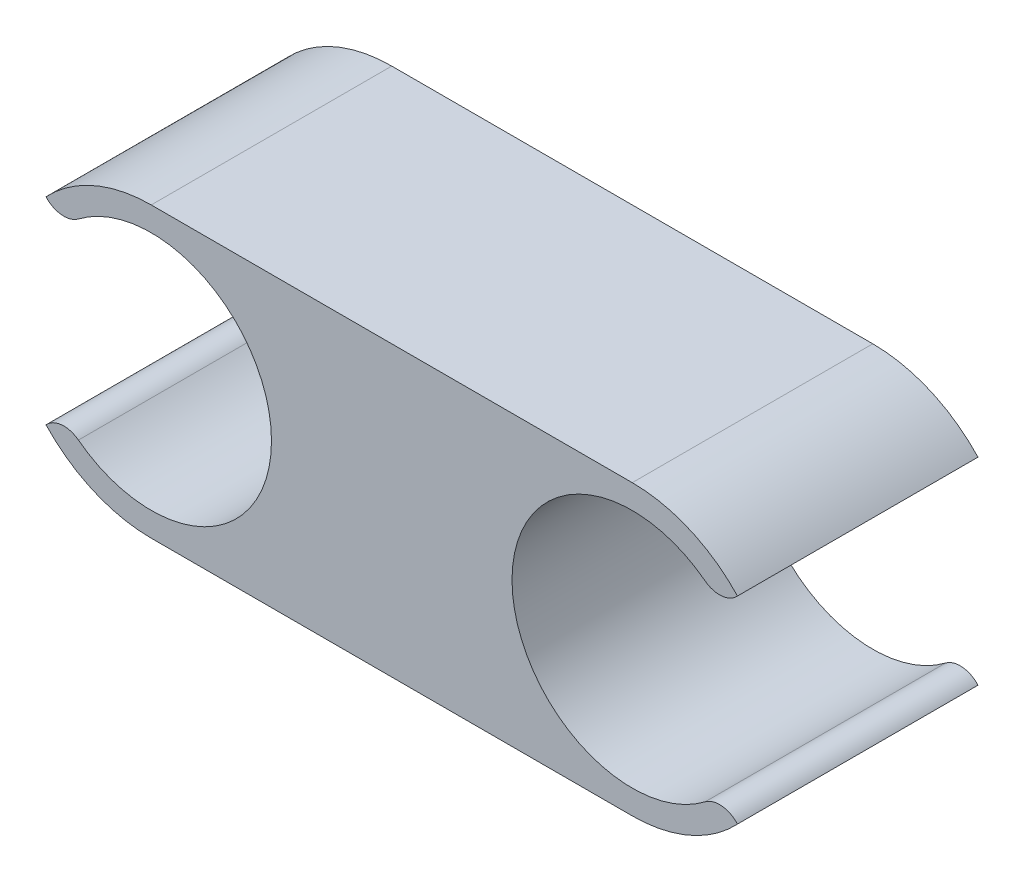
ISO-10303-21;
HEADER;
FILE_DESCRIPTION(('STEP AP214'),'2;1');
FILE_NAME('part.step','',(''),(''),'','','');
FILE_SCHEMA(('AUTOMOTIVE_DESIGN { 1 0 10303 214 1 1 1 1 }'));
ENDSEC;
DATA;
#1=APPLICATION_CONTEXT('core data for automotive mechanical design processes');
#2=APPLICATION_PROTOCOL_DEFINITION('international standard','automotive_design',2000,#1);
#3=PRODUCT_CONTEXT('',#1,'mechanical');
#4=PRODUCT('Part','Part','',(#3));
#5=PRODUCT_RELATED_PRODUCT_CATEGORY('part','',(#4));
#6=PRODUCT_DEFINITION_FORMATION('','',#4);
#7=PRODUCT_DEFINITION_CONTEXT('part definition',#1,'design');
#8=PRODUCT_DEFINITION('design','',#6,#7);
#9=PRODUCT_DEFINITION_SHAPE('','',#8);
#10=(LENGTH_UNIT() NAMED_UNIT(*) SI_UNIT(.MILLI.,.METRE.));
#11=(NAMED_UNIT(*) PLANE_ANGLE_UNIT() SI_UNIT($,.RADIAN.));
#12=(NAMED_UNIT(*) SI_UNIT($,.STERADIAN.) SOLID_ANGLE_UNIT());
#13=UNCERTAINTY_MEASURE_WITH_UNIT(LENGTH_MEASURE(1.E-05),#10,'distance_accuracy_value','');
#14=(GEOMETRIC_REPRESENTATION_CONTEXT(3) GLOBAL_UNCERTAINTY_ASSIGNED_CONTEXT((#13)) GLOBAL_UNIT_ASSIGNED_CONTEXT((#10,
#11,#12)) REPRESENTATION_CONTEXT('',''));
#15=CARTESIAN_POINT('',(0.,0.,0.));
#16=DIRECTION('',(0.,0.,1.));
#17=DIRECTION('',(1.,0.,0.));
#18=AXIS2_PLACEMENT_3D('',#15,#16,#17);
#19=CARTESIAN_POINT('',(0.,-22.1893101255762,8.));
#20=DIRECTION('',(0.,1.,0.));
#21=DIRECTION('',(0.,0.,1.));
#22=AXIS2_PLACEMENT_3D('',#19,#20,#21);
#23=PLANE('',#22);
#24=DIRECTION('',(1.,0.,0.));
#25=VECTOR('',#24,1.);
#26=CARTESIAN_POINT('',(0.,-22.1893101255762,0.));
#27=LINE('',#26,#25);
#28=CARTESIAN_POINT('',(-41.4710554760769,-22.1893101255762,0.));
#29=VERTEX_POINT('',#28);
#30=CARTESIAN_POINT('',(-25.4710554760769,-22.1893101255762,0.));
#31=VERTEX_POINT('',#30);
#32=EDGE_CURVE('E155',#29,#31,#27,.T.);
#33=ORIENTED_EDGE('',*,*,#32,.T.);
#34=DIRECTION('',(0.,0.,-1.));
#35=VECTOR('',#34,1.);
#36=CARTESIAN_POINT('',(-25.4710554760769,-22.1893101255762,8.));
#37=LINE('',#36,#35);
#38=CARTESIAN_POINT('',(-25.4710554760769,-22.1893101255762,8.));
#39=VERTEX_POINT('',#38);
#40=EDGE_CURVE('E135',#39,#31,#37,.T.);
#41=ORIENTED_EDGE('',*,*,#40,.F.);
#42=DIRECTION('',(1.,0.,0.));
#43=VECTOR('',#42,1.);
#44=CARTESIAN_POINT('',(0.,-22.1893101255762,8.));
#45=LINE('',#44,#43);
#46=CARTESIAN_POINT('',(-41.4710554760769,-22.1893101255762,8.));
#47=VERTEX_POINT('',#46);
#48=EDGE_CURVE('E142',#47,#39,#45,.T.);
#49=ORIENTED_EDGE('',*,*,#48,.F.);
#50=DIRECTION('',(0.,0.,-1.));
#51=VECTOR('',#50,1.);
#52=CARTESIAN_POINT('',(-41.4710554760769,-22.1893101255762,8.));
#53=LINE('',#52,#51);
#54=EDGE_CURVE('E216',#47,#29,#53,.T.);
#55=ORIENTED_EDGE('',*,*,#54,.T.);
#56=EDGE_LOOP('',(#33,#41,#49,#55));
#57=FACE_BOUND('',#56,.T.);
#58=ADVANCED_FACE('F41',(#57),#23,.F.);
#59=CARTESIAN_POINT('',(-25.4710554760769,-17.3893101255762,8.));
#60=DIRECTION('',(0.,0.,-1.));
#61=DIRECTION('',(-1.,0.,0.));
#62=AXIS2_PLACEMENT_3D('',#59,#60,#61);
#63=CYLINDRICAL_SURFACE('',#62,4.8);
#64=CARTESIAN_POINT('',(-25.4710554760769,-17.3893101255762,0.));
#65=DIRECTION('',(0.,0.,1.));
#66=DIRECTION('',(1.,0.,0.));
#67=AXIS2_PLACEMENT_3D('',#64,#65,#66);
#68=CIRCLE('',#67,4.8);
#69=CARTESIAN_POINT('',(-21.9710554760769,-20.6741236667076,0.));
#70=VERTEX_POINT('',#69);
#71=EDGE_CURVE('E253',#31,#70,#68,.T.);
#72=ORIENTED_EDGE('',*,*,#71,.T.);
#73=DIRECTION('',(0.,0.,-1.));
#74=VECTOR('',#73,1.);
#75=CARTESIAN_POINT('',(-21.9710554760769,-20.6741236667076,8.));
#76=LINE('',#75,#74);
#77=CARTESIAN_POINT('',(-21.9710554760769,-20.6741236667076,8.));
#78=VERTEX_POINT('',#77);
#79=EDGE_CURVE('E138',#78,#70,#76,.T.);
#80=ORIENTED_EDGE('',*,*,#79,.F.);
#81=CARTESIAN_POINT('',(-25.4710554760769,-17.3893101255762,8.));
#82=DIRECTION('',(0.,0.,1.));
#83=DIRECTION('',(1.,0.,0.));
#84=AXIS2_PLACEMENT_3D('',#81,#82,#83);
#85=CIRCLE('',#84,4.8);
#86=EDGE_CURVE('E130',#39,#78,#85,.T.);
#87=ORIENTED_EDGE('',*,*,#86,.F.);
#88=ORIENTED_EDGE('',*,*,#40,.T.);
#89=EDGE_LOOP('',(#72,#80,#87,#88));
#90=FACE_BOUND('',#89,.T.);
#91=ADVANCED_FACE('F133',(#90),#63,.T.);
#92=CARTESIAN_POINT('',(-25.4710554760769,-17.3893101255762,8.));
#93=DIRECTION('',(0.,0.,-1.));
#94=DIRECTION('',(-1.,0.,0.));
#95=AXIS2_PLACEMENT_3D('',#92,#93,#94);
#96=CYLINDRICAL_SURFACE('',#95,4.);
#97=CARTESIAN_POINT('',(-25.4710554760769,-17.3893101255762,8.));
#98=DIRECTION('',(0.,0.,1.));
#99=DIRECTION('',(1.,0.,0.));
#100=AXIS2_PLACEMENT_3D('',#97,#98,#99);
#101=CIRCLE('',#100,4.);
#102=CARTESIAN_POINT('',(-23.0495353003515,-14.2055638984792,8.));
#103=VERTEX_POINT('',#102);
#104=CARTESIAN_POINT('',(-23.0495353003515,-20.5730563526732,8.));
#105=VERTEX_POINT('',#104);
#106=EDGE_CURVE('E141',#103,#105,#101,.T.);
#107=ORIENTED_EDGE('',*,*,#106,.T.);
#108=DIRECTION('',(0.,0.,-1.));
#109=VECTOR('',#108,1.);
#110=CARTESIAN_POINT('',(-23.0495353003515,-20.5730563526732,8.));
#111=LINE('',#110,#109);
#112=CARTESIAN_POINT('',(-23.0495353003515,-20.5730563526732,0.));
#113=VERTEX_POINT('',#112);
#114=EDGE_CURVE('E161',#105,#113,#111,.T.);
#115=ORIENTED_EDGE('',*,*,#114,.T.);
#116=CARTESIAN_POINT('',(-25.4710554760769,-17.3893101255762,0.));
#117=DIRECTION('',(0.,0.,1.));
#118=DIRECTION('',(1.,0.,0.));
#119=AXIS2_PLACEMENT_3D('',#116,#117,#118);
#120=CIRCLE('',#119,4.);
#121=CARTESIAN_POINT('',(-23.0495353003515,-14.2055638984792,0.));
#122=VERTEX_POINT('',#121);
#123=EDGE_CURVE('E249',#122,#113,#120,.T.);
#124=ORIENTED_EDGE('',*,*,#123,.F.);
#125=DIRECTION('',(0.,0.,-1.));
#126=VECTOR('',#125,1.);
#127=CARTESIAN_POINT('',(-23.0495353003515,-14.2055638984792,8.));
#128=LINE('',#127,#126);
#129=EDGE_CURVE('E157',#122,#103,#128,.F.);
#130=ORIENTED_EDGE('',*,*,#129,.T.);
#131=EDGE_LOOP('',(#107,#115,#124,#130));
#132=FACE_BOUND('',#131,.T.);
#133=ADVANCED_FACE('F278',(#132),#96,.F.);
#134=CARTESIAN_POINT('',(-25.4710554760769,-17.3893101255762,8.));
#135=DIRECTION('',(0.,0.,-1.));
#136=DIRECTION('',(-1.,0.,0.));
#137=AXIS2_PLACEMENT_3D('',#134,#135,#136);
#138=CYLINDRICAL_SURFACE('',#137,4.8);
#139=CARTESIAN_POINT('',(-25.4710554760769,-17.3893101255762,0.));
#140=DIRECTION('',(0.,0.,1.));
#141=DIRECTION('',(1.,0.,0.));
#142=AXIS2_PLACEMENT_3D('',#139,#140,#141);
#143=CIRCLE('',#142,4.8);
#144=CARTESIAN_POINT('',(-21.9710554760769,-14.1044965844448,0.));
#145=VERTEX_POINT('',#144);
#146=CARTESIAN_POINT('',(-25.4710554760769,-12.5893101255762,0.));
#147=VERTEX_POINT('',#146);
#148=EDGE_CURVE('E241',#145,#147,#143,.T.);
#149=ORIENTED_EDGE('',*,*,#148,.T.);
#150=DIRECTION('',(0.,0.,-1.));
#151=VECTOR('',#150,1.);
#152=CARTESIAN_POINT('',(-25.4710554760769,-12.5893101255762,8.));
#153=LINE('',#152,#151);
#154=CARTESIAN_POINT('',(-25.4710554760769,-12.5893101255762,8.));
#155=VERTEX_POINT('',#154);
#156=EDGE_CURVE('E230',#155,#147,#153,.T.);
#157=ORIENTED_EDGE('',*,*,#156,.F.);
#158=CARTESIAN_POINT('',(-25.4710554760769,-17.3893101255762,8.));
#159=DIRECTION('',(0.,0.,1.));
#160=DIRECTION('',(1.,0.,0.));
#161=AXIS2_PLACEMENT_3D('',#158,#159,#160);
#162=CIRCLE('',#161,4.8);
#163=CARTESIAN_POINT('',(-21.9710554760769,-14.1044965844448,8.));
#164=VERTEX_POINT('',#163);
#165=EDGE_CURVE('E243',#164,#155,#162,.T.);
#166=ORIENTED_EDGE('',*,*,#165,.F.);
#167=DIRECTION('',(0.,0.,-1.));
#168=VECTOR('',#167,1.);
#169=CARTESIAN_POINT('',(-21.9710554760769,-14.1044965844448,8.));
#170=LINE('',#169,#168);
#171=EDGE_CURVE('E163',#164,#145,#170,.T.);
#172=ORIENTED_EDGE('',*,*,#171,.T.);
#173=EDGE_LOOP('',(#149,#157,#166,#172));
#174=FACE_BOUND('',#173,.T.);
#175=ADVANCED_FACE('F239',(#174),#138,.T.);
#176=CARTESIAN_POINT('',(0.,-12.5893101255762,8.));
#177=DIRECTION('',(0.,1.,0.));
#178=DIRECTION('',(-1.,0.,0.));
#179=AXIS2_PLACEMENT_3D('',#176,#177,#178);
#180=PLANE('',#179);
#181=DIRECTION('',(1.,0.,0.));
#182=VECTOR('',#181,1.);
#183=CARTESIAN_POINT('',(0.,-12.5893101255762,0.));
#184=LINE('',#183,#182);
#185=CARTESIAN_POINT('',(-41.4710554760769,-12.5893101255762,0.));
#186=VERTEX_POINT('',#185);
#187=EDGE_CURVE('E212',#186,#147,#184,.T.);
#188=ORIENTED_EDGE('',*,*,#187,.F.);
#189=DIRECTION('',(0.,0.,-1.));
#190=VECTOR('',#189,1.);
#191=CARTESIAN_POINT('',(-41.4710554760769,-12.5893101255762,8.));
#192=LINE('',#191,#190);
#193=CARTESIAN_POINT('',(-41.4710554760769,-12.5893101255762,8.));
#194=VERTEX_POINT('',#193);
#195=EDGE_CURVE('E227',#194,#186,#192,.T.);
#196=ORIENTED_EDGE('',*,*,#195,.F.);
#197=DIRECTION('',(1.,0.,0.));
#198=VECTOR('',#197,1.);
#199=CARTESIAN_POINT('',(0.,-12.5893101255762,8.));
#200=LINE('',#199,#198);
#201=EDGE_CURVE('E267',#194,#155,#200,.T.);
#202=ORIENTED_EDGE('',*,*,#201,.T.);
#203=ORIENTED_EDGE('',*,*,#156,.T.);
#204=EDGE_LOOP('',(#188,#196,#202,#203));
#205=FACE_BOUND('',#204,.T.);
#206=ADVANCED_FACE('F285',(#205),#180,.T.);
#207=CARTESIAN_POINT('',(-41.4710554760769,-17.3893101255762,8.));
#208=DIRECTION('',(0.,0.,-1.));
#209=DIRECTION('',(-1.,0.,0.));
#210=AXIS2_PLACEMENT_3D('',#207,#208,#209);
#211=CYLINDRICAL_SURFACE('',#210,4.8);
#212=CARTESIAN_POINT('',(-41.4710554760769,-17.3893101255762,0.));
#213=DIRECTION('',(0.,0.,1.));
#214=DIRECTION('',(1.,0.,0.));
#215=AXIS2_PLACEMENT_3D('',#212,#213,#214);
#216=CIRCLE('',#215,4.8);
#217=CARTESIAN_POINT('',(-44.9710554760769,-14.1044965844449,0.));
#218=VERTEX_POINT('',#217);
#219=EDGE_CURVE('E207',#186,#218,#216,.T.);
#220=ORIENTED_EDGE('',*,*,#219,.T.);
#221=DIRECTION('',(0.,0.,-1.));
#222=VECTOR('',#221,1.);
#223=CARTESIAN_POINT('',(-44.9710554760769,-14.1044965844449,8.));
#224=LINE('',#223,#222);
#225=CARTESIAN_POINT('',(-44.9710554760769,-14.1044965844449,8.));
#226=VERTEX_POINT('',#225);
#227=EDGE_CURVE('E223',#226,#218,#224,.T.);
#228=ORIENTED_EDGE('',*,*,#227,.F.);
#229=CARTESIAN_POINT('',(-41.4710554760769,-17.3893101255762,8.));
#230=DIRECTION('',(0.,0.,1.));
#231=DIRECTION('',(1.,0.,0.));
#232=AXIS2_PLACEMENT_3D('',#229,#230,#231);
#233=CIRCLE('',#232,4.8);
#234=EDGE_CURVE('E264',#194,#226,#233,.T.);
#235=ORIENTED_EDGE('',*,*,#234,.F.);
#236=ORIENTED_EDGE('',*,*,#195,.T.);
#237=EDGE_LOOP('',(#220,#228,#235,#236));
#238=FACE_BOUND('',#237,.T.);
#239=ADVANCED_FACE('F289',(#238),#211,.T.);
#240=CARTESIAN_POINT('',(-41.4710554760769,-17.3893101255762,8.));
#241=DIRECTION('',(0.,0.,-1.));
#242=DIRECTION('',(-1.,0.,0.));
#243=AXIS2_PLACEMENT_3D('',#240,#241,#242);
#244=CYLINDRICAL_SURFACE('',#243,4.00000000000001);
#245=CARTESIAN_POINT('',(-41.4710554760769,-17.3893101255762,0.));
#246=DIRECTION('',(0.,0.,1.));
#247=DIRECTION('',(1.,0.,0.));
#248=AXIS2_PLACEMENT_3D('',#245,#246,#247);
#249=CIRCLE('',#248,4.00000000000001);
#250=CARTESIAN_POINT('',(-43.8925756518024,-20.5730563526732,0.));
#251=VERTEX_POINT('',#250);
#252=CARTESIAN_POINT('',(-43.8925756518024,-14.2055638984792,0.));
#253=VERTEX_POINT('',#252);
#254=EDGE_CURVE('E197',#251,#253,#249,.T.);
#255=ORIENTED_EDGE('',*,*,#254,.F.);
#256=DIRECTION('',(0.,0.,-1.));
#257=VECTOR('',#256,1.);
#258=CARTESIAN_POINT('',(-43.8925756518024,-20.5730563526732,8.));
#259=LINE('',#258,#257);
#260=CARTESIAN_POINT('',(-43.8925756518024,-20.5730563526732,8.));
#261=VERTEX_POINT('',#260);
#262=EDGE_CURVE('E11',#251,#261,#259,.F.);
#263=ORIENTED_EDGE('',*,*,#262,.T.);
#264=CARTESIAN_POINT('',(-41.4710554760769,-17.3893101255762,8.));
#265=DIRECTION('',(0.,0.,1.));
#266=DIRECTION('',(1.,0.,0.));
#267=AXIS2_PLACEMENT_3D('',#264,#265,#266);
#268=CIRCLE('',#267,4.00000000000001);
#269=CARTESIAN_POINT('',(-43.8925756518024,-14.2055638984792,8.));
#270=VERTEX_POINT('',#269);
#271=EDGE_CURVE('E198',#261,#270,#268,.T.);
#272=ORIENTED_EDGE('',*,*,#271,.T.);
#273=DIRECTION('',(0.,0.,-1.));
#274=VECTOR('',#273,1.);
#275=CARTESIAN_POINT('',(-43.8925756518024,-14.2055638984792,8.));
#276=LINE('',#275,#274);
#277=EDGE_CURVE('E50',#270,#253,#276,.T.);
#278=ORIENTED_EDGE('',*,*,#277,.T.);
#279=EDGE_LOOP('',(#255,#263,#272,#278));
#280=FACE_BOUND('',#279,.T.);
#281=ADVANCED_FACE('F196',(#280),#244,.F.);
#282=CARTESIAN_POINT('',(-41.4710554760769,-17.3893101255762,8.));
#283=DIRECTION('',(0.,0.,-1.));
#284=DIRECTION('',(-1.,0.,0.));
#285=AXIS2_PLACEMENT_3D('',#282,#283,#284);
#286=CYLINDRICAL_SURFACE('',#285,4.8);
#287=CARTESIAN_POINT('',(-41.4710554760769,-17.3893101255762,0.));
#288=DIRECTION('',(0.,0.,1.));
#289=DIRECTION('',(1.,0.,0.));
#290=AXIS2_PLACEMENT_3D('',#287,#288,#289);
#291=CIRCLE('',#290,4.8);
#292=CARTESIAN_POINT('',(-44.9710554760769,-20.6741236667076,0.));
#293=VERTEX_POINT('',#292);
#294=EDGE_CURVE('E152',#293,#29,#291,.T.);
#295=ORIENTED_EDGE('',*,*,#294,.T.);
#296=ORIENTED_EDGE('',*,*,#54,.F.);
#297=CARTESIAN_POINT('',(-41.4710554760769,-17.3893101255762,8.));
#298=DIRECTION('',(0.,0.,1.));
#299=DIRECTION('',(1.,0.,0.));
#300=AXIS2_PLACEMENT_3D('',#297,#298,#299);
#301=CIRCLE('',#300,4.8);
#302=CARTESIAN_POINT('',(-44.9710554760769,-20.6741236667076,8.));
#303=VERTEX_POINT('',#302);
#304=EDGE_CURVE('E147',#303,#47,#301,.T.);
#305=ORIENTED_EDGE('',*,*,#304,.F.);
#306=DIRECTION('',(0.,0.,-1.));
#307=VECTOR('',#306,1.);
#308=CARTESIAN_POINT('',(-44.9710554760769,-20.6741236667076,8.));
#309=LINE('',#308,#307);
#310=EDGE_CURVE('E219',#303,#293,#309,.T.);
#311=ORIENTED_EDGE('',*,*,#310,.T.);
#312=EDGE_LOOP('',(#295,#296,#305,#311));
#313=FACE_BOUND('',#312,.T.);
#314=ADVANCED_FACE('F346',(#313),#286,.T.);
#315=CARTESIAN_POINT('',(0.,0.,8.));
#316=DIRECTION('',(0.,0.,1.));
#317=DIRECTION('',(1.,0.,0.));
#318=AXIS2_PLACEMENT_3D('',#315,#316,#317);
#319=PLANE('',#318);
#320=ORIENTED_EDGE('',*,*,#86,.T.);
#321=CARTESIAN_POINT('',(-22.5652312652064,-21.2098055980926,8.));
#322=DIRECTION('',(0.,0.,1.));
#323=DIRECTION('',(1.,0.,0.));
#324=AXIS2_PLACEMENT_3D('',#321,#322,#323);
#325=CIRCLE('',#324,0.8);
#326=EDGE_CURVE('E190',#78,#105,#325,.T.);
#327=ORIENTED_EDGE('',*,*,#326,.T.);
#328=ORIENTED_EDGE('',*,*,#106,.F.);
#329=CARTESIAN_POINT('',(-22.5652312652064,-13.5688146530598,8.));
#330=DIRECTION('',(0.,0.,1.));
#331=DIRECTION('',(1.,0.,0.));
#332=AXIS2_PLACEMENT_3D('',#329,#330,#331);
#333=CIRCLE('',#332,0.8);
#334=EDGE_CURVE('E187',#103,#164,#333,.T.);
#335=ORIENTED_EDGE('',*,*,#334,.T.);
#336=ORIENTED_EDGE('',*,*,#165,.T.);
#337=ORIENTED_EDGE('',*,*,#201,.F.);
#338=ORIENTED_EDGE('',*,*,#234,.T.);
#339=CARTESIAN_POINT('',(-44.3768796869475,-13.5688146530598,8.));
#340=DIRECTION('',(0.,0.,1.));
#341=DIRECTION('',(1.,0.,0.));
#342=AXIS2_PLACEMENT_3D('',#339,#340,#341);
#343=CIRCLE('',#342,0.8);
#344=EDGE_CURVE('E57',#226,#270,#343,.T.);
#345=ORIENTED_EDGE('',*,*,#344,.T.);
#346=ORIENTED_EDGE('',*,*,#271,.F.);
#347=CARTESIAN_POINT('',(-44.3768796869475,-21.2098055980926,8.));
#348=DIRECTION('',(0.,0.,1.));
#349=DIRECTION('',(1.,0.,0.));
#350=AXIS2_PLACEMENT_3D('',#347,#348,#349);
#351=CIRCLE('',#350,0.8);
#352=EDGE_CURVE('E184',#261,#303,#351,.T.);
#353=ORIENTED_EDGE('',*,*,#352,.T.);
#354=ORIENTED_EDGE('',*,*,#304,.T.);
#355=ORIENTED_EDGE('',*,*,#48,.T.);
#356=EDGE_LOOP('',(#320,#327,#328,#335,#336,#337,#338,#345,#346,#353,#354,#355));
#357=FACE_BOUND('',#356,.T.);
#358=ADVANCED_FACE('F145',(#357),#319,.T.);
#359=CARTESIAN_POINT('',(0.,0.,0.));
#360=DIRECTION('',(0.,0.,1.));
#361=DIRECTION('',(1.,0.,0.));
#362=AXIS2_PLACEMENT_3D('',#359,#360,#361);
#363=PLANE('',#362);
#364=ORIENTED_EDGE('',*,*,#123,.T.);
#365=CARTESIAN_POINT('',(-22.5652312652064,-21.2098055980926,0.));
#366=DIRECTION('',(0.,0.,1.));
#367=DIRECTION('',(1.,0.,0.));
#368=AXIS2_PLACEMENT_3D('',#365,#366,#367);
#369=CIRCLE('',#368,0.8);
#370=EDGE_CURVE('E179',#113,#70,#369,.F.);
#371=ORIENTED_EDGE('',*,*,#370,.T.);
#372=ORIENTED_EDGE('',*,*,#71,.F.);
#373=ORIENTED_EDGE('',*,*,#32,.F.);
#374=ORIENTED_EDGE('',*,*,#294,.F.);
#375=CARTESIAN_POINT('',(-44.3768796869475,-21.2098055980926,0.));
#376=DIRECTION('',(0.,0.,1.));
#377=DIRECTION('',(1.,0.,0.));
#378=AXIS2_PLACEMENT_3D('',#375,#376,#377);
#379=CIRCLE('',#378,0.8);
#380=EDGE_CURVE('E173',#293,#251,#379,.F.);
#381=ORIENTED_EDGE('',*,*,#380,.T.);
#382=ORIENTED_EDGE('',*,*,#254,.T.);
#383=CARTESIAN_POINT('',(-44.3768796869475,-13.5688146530598,0.));
#384=DIRECTION('',(0.,0.,1.));
#385=DIRECTION('',(1.,0.,0.));
#386=AXIS2_PLACEMENT_3D('',#383,#384,#385);
#387=CIRCLE('',#386,0.8);
#388=EDGE_CURVE('E170',#253,#218,#387,.F.);
#389=ORIENTED_EDGE('',*,*,#388,.T.);
#390=ORIENTED_EDGE('',*,*,#219,.F.);
#391=ORIENTED_EDGE('',*,*,#187,.T.);
#392=ORIENTED_EDGE('',*,*,#148,.F.);
#393=CARTESIAN_POINT('',(-22.5652312652064,-13.5688146530598,0.));
#394=DIRECTION('',(0.,0.,1.));
#395=DIRECTION('',(1.,0.,0.));
#396=AXIS2_PLACEMENT_3D('',#393,#394,#395);
#397=CIRCLE('',#396,0.8);
#398=EDGE_CURVE('E176',#145,#122,#397,.F.);
#399=ORIENTED_EDGE('',*,*,#398,.T.);
#400=EDGE_LOOP('',(#364,#371,#372,#373,#374,#381,#382,#389,#390,#391,#392,#399));
#401=FACE_BOUND('',#400,.T.);
#402=ADVANCED_FACE('F202',(#401),#363,.F.);
#403=CARTESIAN_POINT('',(-22.5652312652064,-21.2098055980926,8.));
#404=DIRECTION('',(0.,0.,-1.));
#405=DIRECTION('',(-1.,0.,0.));
#406=AXIS2_PLACEMENT_3D('',#403,#404,#405);
#407=CYLINDRICAL_SURFACE('',#406,0.8);
#408=ORIENTED_EDGE('',*,*,#326,.F.);
#409=ORIENTED_EDGE('',*,*,#79,.T.);
#410=ORIENTED_EDGE('',*,*,#370,.F.);
#411=ORIENTED_EDGE('',*,*,#114,.F.);
#412=EDGE_LOOP('',(#408,#409,#410,#411));
#413=FACE_BOUND('',#412,.T.);
#414=ADVANCED_FACE('F281',(#413),#407,.T.);
#415=CARTESIAN_POINT('',(-22.5652312652064,-13.5688146530598,8.));
#416=DIRECTION('',(0.,0.,-1.));
#417=DIRECTION('',(-1.,0.,0.));
#418=AXIS2_PLACEMENT_3D('',#415,#416,#417);
#419=CYLINDRICAL_SURFACE('',#418,0.8);
#420=ORIENTED_EDGE('',*,*,#334,.F.);
#421=ORIENTED_EDGE('',*,*,#129,.F.);
#422=ORIENTED_EDGE('',*,*,#398,.F.);
#423=ORIENTED_EDGE('',*,*,#171,.F.);
#424=EDGE_LOOP('',(#420,#421,#422,#423));
#425=FACE_BOUND('',#424,.T.);
#426=ADVANCED_FACE('F282',(#425),#419,.T.);
#427=CARTESIAN_POINT('',(-44.3768796869475,-21.2098055980926,8.));
#428=DIRECTION('',(0.,0.,-1.));
#429=DIRECTION('',(-1.,0.,0.));
#430=AXIS2_PLACEMENT_3D('',#427,#428,#429);
#431=CYLINDRICAL_SURFACE('',#430,0.8);
#432=ORIENTED_EDGE('',*,*,#352,.F.);
#433=ORIENTED_EDGE('',*,*,#262,.F.);
#434=ORIENTED_EDGE('',*,*,#380,.F.);
#435=ORIENTED_EDGE('',*,*,#310,.F.);
#436=EDGE_LOOP('',(#432,#433,#434,#435));
#437=FACE_BOUND('',#436,.T.);
#438=ADVANCED_FACE('F291',(#437),#431,.T.);
#439=CARTESIAN_POINT('',(-44.3768796869475,-13.5688146530598,8.));
#440=DIRECTION('',(0.,0.,-1.));
#441=DIRECTION('',(-1.,0.,0.));
#442=AXIS2_PLACEMENT_3D('',#439,#440,#441);
#443=CYLINDRICAL_SURFACE('',#442,0.8);
#444=ORIENTED_EDGE('',*,*,#344,.F.);
#445=ORIENTED_EDGE('',*,*,#227,.T.);
#446=ORIENTED_EDGE('',*,*,#388,.F.);
#447=ORIENTED_EDGE('',*,*,#277,.F.);
#448=EDGE_LOOP('',(#444,#445,#446,#447));
#449=FACE_BOUND('',#448,.T.);
#450=ADVANCED_FACE('F43',(#449),#443,.T.);
#451=CLOSED_SHELL('',(#58,#91,#133,#175,#206,#239,#281,#314,#358,#402,#414,#426,#438,#450));
#452=MANIFOLD_SOLID_BREP('B2',#451);
#453=ADVANCED_BREP_SHAPE_REPRESENTATION('',(#18,#452),#14);
#454=SHAPE_DEFINITION_REPRESENTATION(#9,#453);
ENDSEC;
END-ISO-10303-21;
